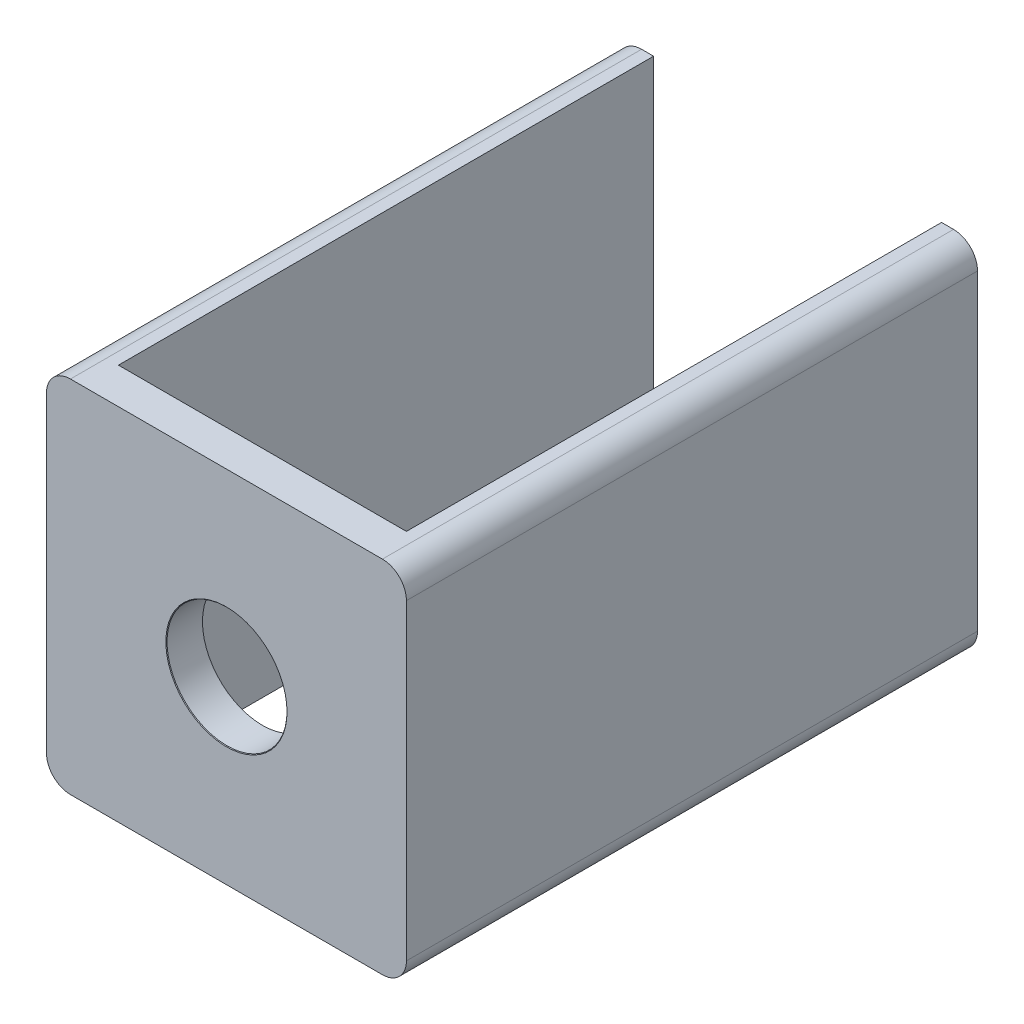
ISO-10303-21;
HEADER;
FILE_DESCRIPTION(('STEP AP214'),'2;1');
FILE_NAME('part.step','',(''),(''),'','','');
FILE_SCHEMA(('AUTOMOTIVE_DESIGN { 1 0 10303 214 1 1 1 1 }'));
ENDSEC;
DATA;
#1=APPLICATION_CONTEXT('core data for automotive mechanical design processes');
#2=APPLICATION_PROTOCOL_DEFINITION('international standard','automotive_design',2000,#1);
#3=PRODUCT_CONTEXT('',#1,'mechanical');
#4=PRODUCT('Part','Part','',(#3));
#5=PRODUCT_RELATED_PRODUCT_CATEGORY('part','',(#4));
#6=PRODUCT_DEFINITION_FORMATION('','',#4);
#7=PRODUCT_DEFINITION_CONTEXT('part definition',#1,'design');
#8=PRODUCT_DEFINITION('design','',#6,#7);
#9=PRODUCT_DEFINITION_SHAPE('','',#8);
#10=(LENGTH_UNIT() NAMED_UNIT(*) SI_UNIT(.MILLI.,.METRE.));
#11=(NAMED_UNIT(*) PLANE_ANGLE_UNIT() SI_UNIT($,.RADIAN.));
#12=(NAMED_UNIT(*) SI_UNIT($,.STERADIAN.) SOLID_ANGLE_UNIT());
#13=UNCERTAINTY_MEASURE_WITH_UNIT(LENGTH_MEASURE(1.E-05),#10,'distance_accuracy_value','');
#14=(GEOMETRIC_REPRESENTATION_CONTEXT(3) GLOBAL_UNCERTAINTY_ASSIGNED_CONTEXT((#13)) GLOBAL_UNIT_ASSIGNED_CONTEXT((#10,
#11,#12)) REPRESENTATION_CONTEXT('',''));
#15=CARTESIAN_POINT('',(0.,0.,0.));
#16=DIRECTION('',(0.,0.,1.));
#17=DIRECTION('',(1.,0.,0.));
#18=AXIS2_PLACEMENT_3D('',#15,#16,#17);
#19=CARTESIAN_POINT('',(0.,0.,0.));
#20=DIRECTION('',(0.,0.,-1.));
#21=DIRECTION('',(-1.,0.,0.));
#22=AXIS2_PLACEMENT_3D('',#19,#20,#21);
#23=PLANE('',#22);
#24=DIRECTION('',(-1.,0.,0.));
#25=VECTOR('',#24,1.);
#26=CARTESIAN_POINT('',(16.8592900259144,4.72225745756208,0.));
#27=LINE('',#26,#25);
#28=CARTESIAN_POINT('',(15.8592900259144,4.72225745756208,0.));
#29=VERTEX_POINT('',#28);
#30=CARTESIAN_POINT('',(15.3592900259144,4.72225745756208,0.));
#31=VERTEX_POINT('',#30);
#32=EDGE_CURVE('E155',#29,#31,#27,.T.);
#33=ORIENTED_EDGE('',*,*,#32,.F.);
#34=CARTESIAN_POINT('',(15.8592900259144,3.72225745756208,0.));
#35=DIRECTION('',(0.,0.,-1.));
#36=DIRECTION('',(-1.,0.,0.));
#37=AXIS2_PLACEMENT_3D('',#34,#35,#36);
#38=CIRCLE('',#37,1.);
#39=CARTESIAN_POINT('',(16.8592900259144,3.72225745756208,0.));
#40=VERTEX_POINT('',#39);
#41=EDGE_CURVE('E166',#29,#40,#38,.T.);
#42=ORIENTED_EDGE('',*,*,#41,.T.);
#43=DIRECTION('',(0.,1.,0.));
#44=VECTOR('',#43,1.);
#45=CARTESIAN_POINT('',(16.8592900259144,4.72225745756208,0.));
#46=LINE('',#45,#44);
#47=CARTESIAN_POINT('',(16.8592900259144,-9.27774254243792,0.));
#48=VERTEX_POINT('',#47);
#49=EDGE_CURVE('E207',#48,#40,#46,.T.);
#50=ORIENTED_EDGE('',*,*,#49,.F.);
#51=CARTESIAN_POINT('',(15.8592900259144,-9.27774254243792,0.));
#52=DIRECTION('',(0.,0.,-1.));
#53=DIRECTION('',(-1.,0.,0.));
#54=AXIS2_PLACEMENT_3D('',#51,#52,#53);
#55=CIRCLE('',#54,1.);
#56=CARTESIAN_POINT('',(15.8592900259144,-10.2777425424379,0.));
#57=VERTEX_POINT('',#56);
#58=EDGE_CURVE('E150',#48,#57,#55,.T.);
#59=ORIENTED_EDGE('',*,*,#58,.T.);
#60=DIRECTION('',(1.,0.,0.));
#61=VECTOR('',#60,1.);
#62=CARTESIAN_POINT('',(16.8592900259144,-10.2777425424379,0.));
#63=LINE('',#62,#61);
#64=CARTESIAN_POINT('',(15.3592900259144,-10.2777425424379,0.));
#65=VERTEX_POINT('',#64);
#66=EDGE_CURVE('E142',#65,#57,#63,.T.);
#67=ORIENTED_EDGE('',*,*,#66,.F.);
#68=DIRECTION('',(0.,1.,0.));
#69=VECTOR('',#68,1.);
#70=CARTESIAN_POINT('',(15.3592900259144,0.,0.));
#71=LINE('',#70,#69);
#72=EDGE_CURVE('E125',#65,#31,#71,.T.);
#73=ORIENTED_EDGE('',*,*,#72,.T.);
#74=EDGE_LOOP('',(#33,#42,#50,#59,#67,#73));
#75=FACE_BOUND('',#74,.T.);
#76=ADVANCED_FACE('F34',(#75),#23,.T.);
#77=CARTESIAN_POINT('',(2.8592900259144,-10.2777425424379,0.));
#78=VERTEX_POINT('',#77);
#79=CARTESIAN_POINT('',(3.3592900259144,-10.2777425424379,0.));
#80=VERTEX_POINT('',#79);
#81=EDGE_CURVE('E151',#78,#80,#63,.T.);
#82=ORIENTED_EDGE('',*,*,#81,.F.);
#83=CARTESIAN_POINT('',(2.8592900259144,-9.27774254243792,0.));
#84=DIRECTION('',(0.,0.,-1.));
#85=DIRECTION('',(-1.,0.,0.));
#86=AXIS2_PLACEMENT_3D('',#83,#84,#85);
#87=CIRCLE('',#86,1.);
#88=CARTESIAN_POINT('',(1.8592900259144,-9.27774254243792,0.));
#89=VERTEX_POINT('',#88);
#90=EDGE_CURVE('E50',#78,#89,#87,.T.);
#91=ORIENTED_EDGE('',*,*,#90,.T.);
#92=DIRECTION('',(0.,-1.,0.));
#93=VECTOR('',#92,1.);
#94=CARTESIAN_POINT('',(1.8592900259144,4.72225745756208,0.));
#95=LINE('',#94,#93);
#96=CARTESIAN_POINT('',(1.8592900259144,3.72225745756208,0.));
#97=VERTEX_POINT('',#96);
#98=EDGE_CURVE('E152',#97,#89,#95,.T.);
#99=ORIENTED_EDGE('',*,*,#98,.F.);
#100=CARTESIAN_POINT('',(2.8592900259144,3.72225745756208,0.));
#101=DIRECTION('',(0.,0.,-1.));
#102=DIRECTION('',(-1.,0.,0.));
#103=AXIS2_PLACEMENT_3D('',#100,#101,#102);
#104=CIRCLE('',#103,1.);
#105=CARTESIAN_POINT('',(2.8592900259144,4.72225745756208,0.));
#106=VERTEX_POINT('',#105);
#107=EDGE_CURVE('E58',#97,#106,#104,.T.);
#108=ORIENTED_EDGE('',*,*,#107,.T.);
#109=CARTESIAN_POINT('',(3.35929002591439,4.72225745756208,0.));
#110=VERTEX_POINT('',#109);
#111=EDGE_CURVE('E199',#110,#106,#27,.T.);
#112=ORIENTED_EDGE('',*,*,#111,.F.);
#113=DIRECTION('',(0.,-1.,0.));
#114=VECTOR('',#113,1.);
#115=CARTESIAN_POINT('',(3.3592900259144,0.,0.));
#116=LINE('',#115,#114);
#117=EDGE_CURVE('E136',#110,#80,#116,.T.);
#118=ORIENTED_EDGE('',*,*,#117,.T.);
#119=EDGE_LOOP('',(#82,#91,#99,#108,#112,#118));
#120=FACE_BOUND('',#119,.T.);
#121=ADVANCED_FACE('F195',(#120),#23,.T.);
#122=CARTESIAN_POINT('',(16.8592900259144,4.72225745756208,23.8));
#123=DIRECTION('',(-1.,0.,0.));
#124=DIRECTION('',(0.,0.,1.));
#125=AXIS2_PLACEMENT_3D('',#122,#123,#124);
#126=PLANE('',#125);
#127=ORIENTED_EDGE('',*,*,#49,.T.);
#128=DIRECTION('',(0.,0.,-1.));
#129=VECTOR('',#128,1.);
#130=CARTESIAN_POINT('',(16.8592900259144,3.72225745756208,23.8));
#131=LINE('',#130,#129);
#132=CARTESIAN_POINT('',(16.8592900259144,3.72225745756208,23.8));
#133=VERTEX_POINT('',#132);
#134=EDGE_CURVE('E171',#40,#133,#131,.F.);
#135=ORIENTED_EDGE('',*,*,#134,.T.);
#136=DIRECTION('',(0.,1.,0.));
#137=VECTOR('',#136,1.);
#138=CARTESIAN_POINT('',(16.8592900259144,4.72225745756208,23.8));
#139=LINE('',#138,#137);
#140=CARTESIAN_POINT('',(16.8592900259144,-9.27774254243792,23.8));
#141=VERTEX_POINT('',#140);
#142=EDGE_CURVE('E154',#141,#133,#139,.T.);
#143=ORIENTED_EDGE('',*,*,#142,.F.);
#144=DIRECTION('',(0.,0.,-1.));
#145=VECTOR('',#144,1.);
#146=CARTESIAN_POINT('',(16.8592900259144,-9.27774254243792,23.8));
#147=LINE('',#146,#145);
#148=EDGE_CURVE('E168',#141,#48,#147,.T.);
#149=ORIENTED_EDGE('',*,*,#148,.T.);
#150=EDGE_LOOP('',(#127,#135,#143,#149));
#151=FACE_BOUND('',#150,.T.);
#152=ADVANCED_FACE('F226',(#151),#126,.F.);
#153=CARTESIAN_POINT('',(16.8592900259144,4.72225745756208,23.8));
#154=DIRECTION('',(0.,-1.,0.));
#155=DIRECTION('',(1.,0.,0.));
#156=AXIS2_PLACEMENT_3D('',#153,#154,#155);
#157=PLANE('',#156);
#158=DIRECTION('',(-1.,0.,0.));
#159=VECTOR('',#158,1.);
#160=CARTESIAN_POINT('',(16.8592900259144,4.72225745756208,23.8));
#161=LINE('',#160,#159);
#162=CARTESIAN_POINT('',(15.8592900259144,4.72225745756208,23.8));
#163=VERTEX_POINT('',#162);
#164=CARTESIAN_POINT('',(2.8592900259144,4.72225745756208,23.8));
#165=VERTEX_POINT('',#164);
#166=EDGE_CURVE('E212',#163,#165,#161,.T.);
#167=ORIENTED_EDGE('',*,*,#166,.F.);
#168=DIRECTION('',(0.,0.,-1.));
#169=VECTOR('',#168,1.);
#170=CARTESIAN_POINT('',(15.8592900259144,4.72225745756208,23.8));
#171=LINE('',#170,#169);
#172=EDGE_CURVE('E161',#163,#29,#171,.T.);
#173=ORIENTED_EDGE('',*,*,#172,.T.);
#174=ORIENTED_EDGE('',*,*,#32,.T.);
#175=DIRECTION('',(0.,0.,-1.));
#176=VECTOR('',#175,1.);
#177=CARTESIAN_POINT('',(15.3592900259144,4.72225745756208,23.8));
#178=LINE('',#177,#176);
#179=CARTESIAN_POINT('',(15.3592900259144,4.72225745756208,22.3));
#180=VERTEX_POINT('',#179);
#181=EDGE_CURVE('E132',#180,#31,#178,.T.);
#182=ORIENTED_EDGE('',*,*,#181,.F.);
#183=DIRECTION('',(-1.,0.,0.));
#184=VECTOR('',#183,1.);
#185=CARTESIAN_POINT('',(0.,4.72225745756208,22.3));
#186=LINE('',#185,#184);
#187=CARTESIAN_POINT('',(3.35929002591439,4.72225745756208,22.3));
#188=VERTEX_POINT('',#187);
#189=EDGE_CURVE('E338',#180,#188,#186,.T.);
#190=ORIENTED_EDGE('',*,*,#189,.T.);
#191=DIRECTION('',(0.,0.,-1.));
#192=VECTOR('',#191,1.);
#193=CARTESIAN_POINT('',(3.35929002591439,4.72225745756208,23.8));
#194=LINE('',#193,#192);
#195=EDGE_CURVE('E206',#188,#110,#194,.T.);
#196=ORIENTED_EDGE('',*,*,#195,.T.);
#197=ORIENTED_EDGE('',*,*,#111,.T.);
#198=DIRECTION('',(0.,0.,-1.));
#199=VECTOR('',#198,1.);
#200=CARTESIAN_POINT('',(2.8592900259144,4.72225745756208,23.8));
#201=LINE('',#200,#199);
#202=EDGE_CURVE('E159',#106,#165,#201,.F.);
#203=ORIENTED_EDGE('',*,*,#202,.T.);
#204=EDGE_LOOP('',(#167,#173,#174,#182,#190,#196,#197,#203));
#205=FACE_BOUND('',#204,.T.);
#206=ADVANCED_FACE('F203',(#205),#157,.F.);
#207=CARTESIAN_POINT('',(1.8592900259144,4.72225745756208,23.8));
#208=DIRECTION('',(1.,0.,0.));
#209=DIRECTION('',(0.,1.,0.));
#210=AXIS2_PLACEMENT_3D('',#207,#208,#209);
#211=PLANE('',#210);
#212=ORIENTED_EDGE('',*,*,#98,.T.);
#213=DIRECTION('',(0.,0.,-1.));
#214=VECTOR('',#213,1.);
#215=CARTESIAN_POINT('',(1.8592900259144,-9.27774254243792,23.8));
#216=LINE('',#215,#214);
#217=CARTESIAN_POINT('',(1.8592900259144,-9.27774254243792,23.8));
#218=VERTEX_POINT('',#217);
#219=EDGE_CURVE('E11',#89,#218,#216,.F.);
#220=ORIENTED_EDGE('',*,*,#219,.T.);
#221=DIRECTION('',(0.,-1.,0.));
#222=VECTOR('',#221,1.);
#223=CARTESIAN_POINT('',(1.8592900259144,4.72225745756208,23.8));
#224=LINE('',#223,#222);
#225=CARTESIAN_POINT('',(1.8592900259144,3.72225745756208,23.8));
#226=VERTEX_POINT('',#225);
#227=EDGE_CURVE('E193',#226,#218,#224,.T.);
#228=ORIENTED_EDGE('',*,*,#227,.F.);
#229=DIRECTION('',(0.,0.,-1.));
#230=VECTOR('',#229,1.);
#231=CARTESIAN_POINT('',(1.8592900259144,3.72225745756208,23.8));
#232=LINE('',#231,#230);
#233=EDGE_CURVE('E43',#226,#97,#232,.T.);
#234=ORIENTED_EDGE('',*,*,#233,.T.);
#235=EDGE_LOOP('',(#212,#220,#228,#234));
#236=FACE_BOUND('',#235,.T.);
#237=ADVANCED_FACE('F190',(#236),#211,.F.);
#238=CARTESIAN_POINT('',(16.8592900259144,-10.2777425424379,23.8));
#239=DIRECTION('',(0.,1.,0.));
#240=DIRECTION('',(-1.,0.,0.));
#241=AXIS2_PLACEMENT_3D('',#238,#239,#240);
#242=PLANE('',#241);
#243=ORIENTED_EDGE('',*,*,#66,.T.);
#244=DIRECTION('',(0.,0.,-1.));
#245=VECTOR('',#244,1.);
#246=CARTESIAN_POINT('',(15.8592900259144,-10.2777425424379,23.8));
#247=LINE('',#246,#245);
#248=CARTESIAN_POINT('',(15.8592900259144,-10.2777425424379,23.8));
#249=VERTEX_POINT('',#248);
#250=EDGE_CURVE('E184',#57,#249,#247,.F.);
#251=ORIENTED_EDGE('',*,*,#250,.T.);
#252=DIRECTION('',(1.,0.,0.));
#253=VECTOR('',#252,1.);
#254=CARTESIAN_POINT('',(16.8592900259144,-10.2777425424379,23.8));
#255=LINE('',#254,#253);
#256=CARTESIAN_POINT('',(2.8592900259144,-10.2777425424379,23.8));
#257=VERTEX_POINT('',#256);
#258=EDGE_CURVE('E162',#257,#249,#255,.T.);
#259=ORIENTED_EDGE('',*,*,#258,.F.);
#260=DIRECTION('',(0.,0.,-1.));
#261=VECTOR('',#260,1.);
#262=CARTESIAN_POINT('',(2.8592900259144,-10.2777425424379,23.8));
#263=LINE('',#262,#261);
#264=EDGE_CURVE('E181',#257,#78,#263,.T.);
#265=ORIENTED_EDGE('',*,*,#264,.T.);
#266=ORIENTED_EDGE('',*,*,#81,.T.);
#267=DIRECTION('',(0.,0.,-1.));
#268=VECTOR('',#267,1.);
#269=CARTESIAN_POINT('',(3.3592900259144,-10.2777425424379,23.8));
#270=LINE('',#269,#268);
#271=CARTESIAN_POINT('',(3.3592900259144,-10.2777425424379,22.3));
#272=VERTEX_POINT('',#271);
#273=EDGE_CURVE('E147',#272,#80,#270,.T.);
#274=ORIENTED_EDGE('',*,*,#273,.F.);
#275=DIRECTION('',(1.,0.,0.));
#276=VECTOR('',#275,1.);
#277=CARTESIAN_POINT('',(0.,-10.2777425424379,22.3));
#278=LINE('',#277,#276);
#279=CARTESIAN_POINT('',(15.3592900259144,-10.2777425424379,22.3));
#280=VERTEX_POINT('',#279);
#281=EDGE_CURVE('E146',#272,#280,#278,.T.);
#282=ORIENTED_EDGE('',*,*,#281,.T.);
#283=DIRECTION('',(0.,0.,-1.));
#284=VECTOR('',#283,1.);
#285=CARTESIAN_POINT('',(15.3592900259144,-10.2777425424379,23.8));
#286=LINE('',#285,#284);
#287=EDGE_CURVE('E129',#280,#65,#286,.T.);
#288=ORIENTED_EDGE('',*,*,#287,.T.);
#289=EDGE_LOOP('',(#243,#251,#259,#265,#266,#274,#282,#288));
#290=FACE_BOUND('',#289,.T.);
#291=ADVANCED_FACE('F141',(#290),#242,.F.);
#292=CARTESIAN_POINT('',(0.,0.,23.8));
#293=DIRECTION('',(0.,0.,-1.));
#294=DIRECTION('',(-1.,0.,0.));
#295=AXIS2_PLACEMENT_3D('',#292,#293,#294);
#296=PLANE('',#295);
#297=CARTESIAN_POINT('',(9.3592900259144,-2.77774254243792,23.8));
#298=DIRECTION('',(0.,0.,1.));
#299=DIRECTION('',(1.,0.,0.));
#300=AXIS2_PLACEMENT_3D('',#297,#298,#299);
#301=CIRCLE('',#300,2.525);
#302=CARTESIAN_POINT('',(11.8842900259144,-2.77774254243792,23.8));
#303=VERTEX_POINT('',#302);
#304=EDGE_CURVE('E331',#303,#303,#301,.T.);
#305=ORIENTED_EDGE('',*,*,#304,.F.);
#306=EDGE_LOOP('',(#305));
#307=FACE_BOUND('',#306,.T.);
#308=ORIENTED_EDGE('',*,*,#142,.T.);
#309=CARTESIAN_POINT('',(15.8592900259144,3.72225745756208,23.8));
#310=DIRECTION('',(0.,0.,-1.));
#311=DIRECTION('',(-1.,0.,0.));
#312=AXIS2_PLACEMENT_3D('',#309,#310,#311);
#313=CIRCLE('',#312,1.);
#314=EDGE_CURVE('E179',#133,#163,#313,.F.);
#315=ORIENTED_EDGE('',*,*,#314,.T.);
#316=ORIENTED_EDGE('',*,*,#166,.T.);
#317=CARTESIAN_POINT('',(2.8592900259144,3.72225745756208,23.8));
#318=DIRECTION('',(0.,0.,-1.));
#319=DIRECTION('',(-1.,0.,0.));
#320=AXIS2_PLACEMENT_3D('',#317,#318,#319);
#321=CIRCLE('',#320,1.);
#322=EDGE_CURVE('E173',#165,#226,#321,.F.);
#323=ORIENTED_EDGE('',*,*,#322,.T.);
#324=ORIENTED_EDGE('',*,*,#227,.T.);
#325=CARTESIAN_POINT('',(2.8592900259144,-9.27774254243792,23.8));
#326=DIRECTION('',(0.,0.,-1.));
#327=DIRECTION('',(-1.,0.,0.));
#328=AXIS2_PLACEMENT_3D('',#325,#326,#327);
#329=CIRCLE('',#328,1.);
#330=EDGE_CURVE('E175',#218,#257,#329,.F.);
#331=ORIENTED_EDGE('',*,*,#330,.T.);
#332=ORIENTED_EDGE('',*,*,#258,.T.);
#333=CARTESIAN_POINT('',(15.8592900259144,-9.27774254243792,23.8));
#334=DIRECTION('',(0.,0.,-1.));
#335=DIRECTION('',(-1.,0.,0.));
#336=AXIS2_PLACEMENT_3D('',#333,#334,#335);
#337=CIRCLE('',#336,1.);
#338=EDGE_CURVE('E177',#249,#141,#337,.F.);
#339=ORIENTED_EDGE('',*,*,#338,.T.);
#340=EDGE_LOOP('',(#308,#315,#316,#323,#324,#331,#332,#339));
#341=FACE_BOUND('',#340,.T.);
#342=ADVANCED_FACE('F210',(#307,#341),#296,.F.);
#343=CARTESIAN_POINT('',(15.3592900259144,4.72225745756208,23.8));
#344=DIRECTION('',(-1.,0.,0.));
#345=DIRECTION('',(0.,0.,1.));
#346=AXIS2_PLACEMENT_3D('',#343,#344,#345);
#347=PLANE('',#346);
#348=ORIENTED_EDGE('',*,*,#72,.F.);
#349=ORIENTED_EDGE('',*,*,#287,.F.);
#350=DIRECTION('',(0.,1.,0.));
#351=VECTOR('',#350,1.);
#352=CARTESIAN_POINT('',(15.3592900259144,0.,22.3));
#353=LINE('',#352,#351);
#354=EDGE_CURVE('E336',#280,#180,#353,.T.);
#355=ORIENTED_EDGE('',*,*,#354,.T.);
#356=ORIENTED_EDGE('',*,*,#181,.T.);
#357=EDGE_LOOP('',(#348,#349,#355,#356));
#358=FACE_BOUND('',#357,.T.);
#359=ADVANCED_FACE('F127',(#358),#347,.T.);
#360=CARTESIAN_POINT('',(3.35929002591439,4.72225745756208,23.8));
#361=DIRECTION('',(1.,0.,0.));
#362=DIRECTION('',(0.,1.,0.));
#363=AXIS2_PLACEMENT_3D('',#360,#361,#362);
#364=PLANE('',#363);
#365=ORIENTED_EDGE('',*,*,#117,.F.);
#366=ORIENTED_EDGE('',*,*,#195,.F.);
#367=DIRECTION('',(0.,-1.,0.));
#368=VECTOR('',#367,1.);
#369=CARTESIAN_POINT('',(3.3592900259144,0.,22.3));
#370=LINE('',#369,#368);
#371=EDGE_CURVE('E339',#188,#272,#370,.T.);
#372=ORIENTED_EDGE('',*,*,#371,.T.);
#373=ORIENTED_EDGE('',*,*,#273,.T.);
#374=EDGE_LOOP('',(#365,#366,#372,#373));
#375=FACE_BOUND('',#374,.T.);
#376=ADVANCED_FACE('F241',(#375),#364,.T.);
#377=CARTESIAN_POINT('',(0.,0.,22.3));
#378=DIRECTION('',(0.,0.,-1.));
#379=DIRECTION('',(-1.,0.,0.));
#380=AXIS2_PLACEMENT_3D('',#377,#378,#379);
#381=PLANE('',#380);
#382=CARTESIAN_POINT('',(9.3592900259144,-2.77774254243792,22.3));
#383=DIRECTION('',(0.,0.,-1.));
#384=DIRECTION('',(-1.,0.,0.));
#385=AXIS2_PLACEMENT_3D('',#382,#383,#384);
#386=CIRCLE('',#385,2.5);
#387=CARTESIAN_POINT('',(6.8592900259144,-2.77774254243792,22.3));
#388=VERTEX_POINT('',#387);
#389=EDGE_CURVE('E38',#388,#388,#386,.T.);
#390=ORIENTED_EDGE('',*,*,#389,.F.);
#391=EDGE_LOOP('',(#390));
#392=FACE_BOUND('',#391,.T.);
#393=ORIENTED_EDGE('',*,*,#354,.F.);
#394=ORIENTED_EDGE('',*,*,#281,.F.);
#395=ORIENTED_EDGE('',*,*,#371,.F.);
#396=ORIENTED_EDGE('',*,*,#189,.F.);
#397=EDGE_LOOP('',(#393,#394,#395,#396));
#398=FACE_BOUND('',#397,.T.);
#399=ADVANCED_FACE('F232',(#392,#398),#381,.T.);
#400=CARTESIAN_POINT('',(15.8592900259144,3.72225745756208,23.8));
#401=DIRECTION('',(0.,0.,-1.));
#402=DIRECTION('',(-1.,0.,0.));
#403=AXIS2_PLACEMENT_3D('',#400,#401,#402);
#404=CYLINDRICAL_SURFACE('',#403,1.);
#405=ORIENTED_EDGE('',*,*,#314,.F.);
#406=ORIENTED_EDGE('',*,*,#134,.F.);
#407=ORIENTED_EDGE('',*,*,#41,.F.);
#408=ORIENTED_EDGE('',*,*,#172,.F.);
#409=EDGE_LOOP('',(#405,#406,#407,#408));
#410=FACE_BOUND('',#409,.T.);
#411=ADVANCED_FACE('F229',(#410),#404,.T.);
#412=CARTESIAN_POINT('',(15.8592900259144,-9.27774254243792,23.8));
#413=DIRECTION('',(0.,0.,-1.));
#414=DIRECTION('',(-1.,0.,0.));
#415=AXIS2_PLACEMENT_3D('',#412,#413,#414);
#416=CYLINDRICAL_SURFACE('',#415,1.);
#417=ORIENTED_EDGE('',*,*,#338,.F.);
#418=ORIENTED_EDGE('',*,*,#250,.F.);
#419=ORIENTED_EDGE('',*,*,#58,.F.);
#420=ORIENTED_EDGE('',*,*,#148,.F.);
#421=EDGE_LOOP('',(#417,#418,#419,#420));
#422=FACE_BOUND('',#421,.T.);
#423=ADVANCED_FACE('F231',(#422),#416,.T.);
#424=CARTESIAN_POINT('',(2.8592900259144,-9.27774254243792,23.8));
#425=DIRECTION('',(0.,0.,-1.));
#426=DIRECTION('',(-1.,0.,0.));
#427=AXIS2_PLACEMENT_3D('',#424,#425,#426);
#428=CYLINDRICAL_SURFACE('',#427,1.);
#429=ORIENTED_EDGE('',*,*,#330,.F.);
#430=ORIENTED_EDGE('',*,*,#219,.F.);
#431=ORIENTED_EDGE('',*,*,#90,.F.);
#432=ORIENTED_EDGE('',*,*,#264,.F.);
#433=EDGE_LOOP('',(#429,#430,#431,#432));
#434=FACE_BOUND('',#433,.T.);
#435=ADVANCED_FACE('F238',(#434),#428,.T.);
#436=CARTESIAN_POINT('',(2.8592900259144,3.72225745756208,23.8));
#437=DIRECTION('',(0.,0.,-1.));
#438=DIRECTION('',(-1.,0.,0.));
#439=AXIS2_PLACEMENT_3D('',#436,#437,#438);
#440=CYLINDRICAL_SURFACE('',#439,1.);
#441=ORIENTED_EDGE('',*,*,#322,.F.);
#442=ORIENTED_EDGE('',*,*,#202,.F.);
#443=ORIENTED_EDGE('',*,*,#107,.F.);
#444=ORIENTED_EDGE('',*,*,#233,.F.);
#445=EDGE_LOOP('',(#441,#442,#443,#444));
#446=FACE_BOUND('',#445,.T.);
#447=ADVANCED_FACE('F36',(#446),#440,.T.);
#448=CARTESIAN_POINT('',(9.3592900259144,-2.77774254243792,23.8));
#449=DIRECTION('',(0.,0.,1.));
#450=DIRECTION('',(1.,0.,0.));
#451=AXIS2_PLACEMENT_3D('',#448,#449,#450);
#452=CONICAL_SURFACE('',#451,2.525,0.785398163397448);
#453=CARTESIAN_POINT('',(9.3592900259144,-2.77774254243792,23.775));
#454=DIRECTION('',(0.,0.,1.));
#455=DIRECTION('',(1.,0.,0.));
#456=AXIS2_PLACEMENT_3D('',#453,#454,#455);
#457=CIRCLE('',#456,2.5);
#458=CARTESIAN_POINT('',(11.8592900259144,-2.77774254243792,23.775));
#459=VERTEX_POINT('',#458);
#460=EDGE_CURVE('E330',#459,#459,#457,.T.);
#461=ORIENTED_EDGE('',*,*,#460,.F.);
#462=EDGE_LOOP('',(#461));
#463=FACE_BOUND('',#462,.T.);
#464=ORIENTED_EDGE('',*,*,#304,.T.);
#465=EDGE_LOOP('',(#464));
#466=FACE_BOUND('',#465,.T.);
#467=ADVANCED_FACE('F304',(#463,#466),#452,.F.);
#468=CARTESIAN_POINT('',(9.3592900259144,-2.77774254243792,23.8));
#469=DIRECTION('',(0.,0.,1.));
#470=DIRECTION('',(1.,0.,0.));
#471=AXIS2_PLACEMENT_3D('',#468,#469,#470);
#472=CYLINDRICAL_SURFACE('',#471,2.5);
#473=ORIENTED_EDGE('',*,*,#389,.T.);
#474=EDGE_LOOP('',(#473));
#475=FACE_BOUND('',#474,.T.);
#476=ORIENTED_EDGE('',*,*,#460,.T.);
#477=EDGE_LOOP('',(#476));
#478=FACE_BOUND('',#477,.T.);
#479=ADVANCED_FACE('F309',(#475,#478),#472,.F.);
#480=CLOSED_SHELL('',(#76,#121,#152,#206,#237,#291,#342,#359,#376,#399,#411,#423,#435,#447,#467,#479));
#481=MANIFOLD_SOLID_BREP('B2',#480);
#482=ADVANCED_BREP_SHAPE_REPRESENTATION('',(#18,#481),#14);
#483=SHAPE_DEFINITION_REPRESENTATION(#9,#482);
ENDSEC;
END-ISO-10303-21;
